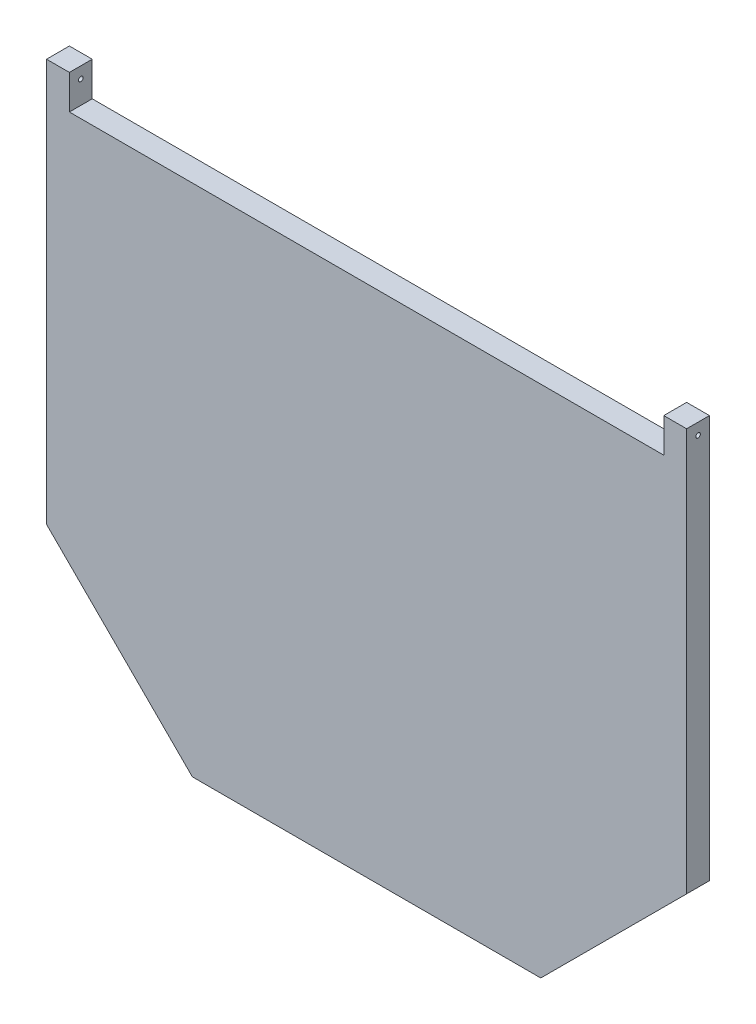
ISO-10303-21;
HEADER;
FILE_DESCRIPTION(('STEP AP214'),'2;1');
FILE_NAME('part.step','',(''),(''),'','','');
FILE_SCHEMA(('AUTOMOTIVE_DESIGN { 1 0 10303 214 1 1 1 1 }'));
ENDSEC;
DATA;
#1=APPLICATION_CONTEXT('core data for automotive mechanical design processes');
#2=APPLICATION_PROTOCOL_DEFINITION('international standard','automotive_design',2000,#1);
#3=PRODUCT_CONTEXT('',#1,'mechanical');
#4=PRODUCT('Part','Part','',(#3));
#5=PRODUCT_RELATED_PRODUCT_CATEGORY('part','',(#4));
#6=PRODUCT_DEFINITION_FORMATION('','',#4);
#7=PRODUCT_DEFINITION_CONTEXT('part definition',#1,'design');
#8=PRODUCT_DEFINITION('design','',#6,#7);
#9=PRODUCT_DEFINITION_SHAPE('','',#8);
#10=(LENGTH_UNIT() NAMED_UNIT(*) SI_UNIT(.MILLI.,.METRE.));
#11=(NAMED_UNIT(*) PLANE_ANGLE_UNIT() SI_UNIT($,.RADIAN.));
#12=(NAMED_UNIT(*) SI_UNIT($,.STERADIAN.) SOLID_ANGLE_UNIT());
#13=UNCERTAINTY_MEASURE_WITH_UNIT(LENGTH_MEASURE(1.E-05),#10,'distance_accuracy_value','');
#14=(GEOMETRIC_REPRESENTATION_CONTEXT(3) GLOBAL_UNCERTAINTY_ASSIGNED_CONTEXT((#13)) GLOBAL_UNIT_ASSIGNED_CONTEXT((#10,
#11,#12)) REPRESENTATION_CONTEXT('',''));
#15=CARTESIAN_POINT('',(0.,0.,0.));
#16=DIRECTION('',(0.,0.,1.));
#17=DIRECTION('',(1.,0.,0.));
#18=AXIS2_PLACEMENT_3D('',#15,#16,#17);
#19=CARTESIAN_POINT('',(0.,0.,0.));
#20=DIRECTION('',(0.,0.,1.));
#21=DIRECTION('',(1.,0.,0.));
#22=AXIS2_PLACEMENT_3D('',#19,#20,#21);
#23=PLANE('',#22);
#24=DIRECTION('',(0.707317073170731,-0.706896426643388,0.));
#25=VECTOR('',#24,1.);
#26=CARTESIAN_POINT('',(10.3378,-219.4901416915,0.));
#27=LINE('',#26,#25);
#28=CARTESIAN_POINT('',(10.3378,-219.4901416915,0.));
#29=VERTEX_POINT('',#28);
#30=CARTESIAN_POINT('',(85.3062558436216,-294.414013257707,0.));
#31=VERTEX_POINT('',#30);
#32=EDGE_CURVE('E222',#29,#31,#27,.T.);
#33=ORIENTED_EDGE('',*,*,#32,.T.);
#34=DIRECTION('',(-0.382546027837966,-0.923936435359811,0.));
#35=VECTOR('',#34,1.);
#36=CARTESIAN_POINT('',(86.2099060705805,-292.2314906101,0.));
#37=LINE('',#36,#35);
#38=CARTESIAN_POINT('',(86.2099060705805,-292.2314906101,0.));
#39=VERTEX_POINT('',#38);
#40=EDGE_CURVE('E51',#39,#31,#37,.T.);
#41=ORIENTED_EDGE('',*,*,#40,.F.);
#42=DIRECTION('',(0.707317073170731,-0.706896426643388,0.));
#43=VECTOR('',#42,1.);
#44=CARTESIAN_POINT('',(12.5203226476069,-218.585730909957,0.));
#45=LINE('',#44,#43);
#46=CARTESIAN_POINT('',(12.5203226476069,-218.585730909957,0.));
#47=VERTEX_POINT('',#46);
#48=EDGE_CURVE('E208',#47,#39,#45,.T.);
#49=ORIENTED_EDGE('',*,*,#48,.F.);
#50=DIRECTION('',(0.,-1.,0.));
#51=VECTOR('',#50,1.);
#52=CARTESIAN_POINT('',(12.5203226476069,-45.9739999999999,0.));
#53=LINE('',#52,#51);
#54=CARTESIAN_POINT('',(12.5203226476069,-45.9739999999999,0.));
#55=VERTEX_POINT('',#54);
#56=EDGE_CURVE('E211',#55,#47,#53,.T.);
#57=ORIENTED_EDGE('',*,*,#56,.F.);
#58=DIRECTION('',(1.,0.,0.));
#59=VECTOR('',#58,1.);
#60=CARTESIAN_POINT('',(10.3378,-45.9739999999999,0.));
#61=LINE('',#60,#59);
#62=CARTESIAN_POINT('',(10.3378,-45.9739999999999,0.));
#63=VERTEX_POINT('',#62);
#64=EDGE_CURVE('E227',#63,#55,#61,.T.);
#65=ORIENTED_EDGE('',*,*,#64,.F.);
#66=DIRECTION('',(0.,-1.,0.));
#67=VECTOR('',#66,1.);
#68=CARTESIAN_POINT('',(10.3378,-45.9739999999999,0.));
#69=LINE('',#68,#67);
#70=EDGE_CURVE('E224',#63,#29,#69,.T.);
#71=ORIENTED_EDGE('',*,*,#70,.T.);
#72=EDGE_LOOP('',(#33,#41,#49,#57,#65,#71));
#73=FACE_BOUND('',#72,.T.);
#74=DIRECTION('',(-1.,0.,0.));
#75=VECTOR('',#74,1.);
#76=CARTESIAN_POINT('',(0.,0.,0.));
#77=LINE('',#76,#75);
#78=CARTESIAN_POINT('',(12.7,0.,0.));
#79=VERTEX_POINT('',#78);
#80=CARTESIAN_POINT('',(0.,0.,0.));
#81=VERTEX_POINT('',#80);
#82=EDGE_CURVE('E345',#79,#81,#77,.T.);
#83=ORIENTED_EDGE('',*,*,#82,.F.);
#84=DIRECTION('',(0.,-1.,0.));
#85=VECTOR('',#84,1.);
#86=CARTESIAN_POINT('',(12.7,0.,0.));
#87=LINE('',#86,#85);
#88=CARTESIAN_POINT('',(12.7,-19.05,0.));
#89=VERTEX_POINT('',#88);
#90=EDGE_CURVE('E292',#79,#89,#87,.T.);
#91=ORIENTED_EDGE('',*,*,#90,.T.);
#92=DIRECTION('',(1.,0.,0.));
#93=VECTOR('',#92,1.);
#94=CARTESIAN_POINT('',(12.7,-19.05,0.));
#95=LINE('',#94,#93);
#96=CARTESIAN_POINT('',(342.9,-19.05,0.));
#97=VERTEX_POINT('',#96);
#98=EDGE_CURVE('E295',#89,#97,#95,.T.);
#99=ORIENTED_EDGE('',*,*,#98,.T.);
#100=DIRECTION('',(0.,1.,0.));
#101=VECTOR('',#100,1.);
#102=CARTESIAN_POINT('',(342.9,0.,0.));
#103=LINE('',#102,#101);
#104=CARTESIAN_POINT('',(342.9,0.,0.));
#105=VERTEX_POINT('',#104);
#106=EDGE_CURVE('E299',#97,#105,#103,.T.);
#107=ORIENTED_EDGE('',*,*,#106,.T.);
#108=CARTESIAN_POINT('',(355.6,0.,0.));
#109=VERTEX_POINT('',#108);
#110=EDGE_CURVE('E322',#109,#105,#77,.T.);
#111=ORIENTED_EDGE('',*,*,#110,.F.);
#112=DIRECTION('',(0.,1.,0.));
#113=VECTOR('',#112,1.);
#114=CARTESIAN_POINT('',(355.6,-223.774,0.));
#115=LINE('',#114,#113);
#116=CARTESIAN_POINT('',(355.6,-223.774,0.));
#117=VERTEX_POINT('',#116);
#118=EDGE_CURVE('E343',#117,#109,#115,.T.);
#119=ORIENTED_EDGE('',*,*,#118,.F.);
#120=DIRECTION('',(0.707317073170732,0.706896426643387,0.));
#121=VECTOR('',#120,1.);
#122=CARTESIAN_POINT('',(274.574,-304.751813257707,0.));
#123=LINE('',#122,#121);
#124=CARTESIAN_POINT('',(274.574,-304.751813257707,0.));
#125=VERTEX_POINT('',#124);
#126=EDGE_CURVE('E341',#125,#117,#123,.T.);
#127=ORIENTED_EDGE('',*,*,#126,.F.);
#128=DIRECTION('',(1.,0.,0.));
#129=VECTOR('',#128,1.);
#130=CARTESIAN_POINT('',(81.026,-304.751813257707,0.));
#131=LINE('',#130,#129);
#132=CARTESIAN_POINT('',(81.026,-304.751813257707,0.));
#133=VERTEX_POINT('',#132);
#134=EDGE_CURVE('E339',#133,#125,#131,.T.);
#135=ORIENTED_EDGE('',*,*,#134,.F.);
#136=DIRECTION('',(0.707317073170731,-0.706896426643388,0.));
#137=VECTOR('',#136,1.);
#138=CARTESIAN_POINT('',(0.,-223.774,0.));
#139=LINE('',#138,#137);
#140=CARTESIAN_POINT('',(0.,-223.774,0.));
#141=VERTEX_POINT('',#140);
#142=EDGE_CURVE('E337',#141,#133,#139,.T.);
#143=ORIENTED_EDGE('',*,*,#142,.F.);
#144=DIRECTION('',(0.,-1.,0.));
#145=VECTOR('',#144,1.);
#146=CARTESIAN_POINT('',(0.,0.,0.));
#147=LINE('',#146,#145);
#148=EDGE_CURVE('E311',#81,#141,#147,.T.);
#149=ORIENTED_EDGE('',*,*,#148,.F.);
#150=EDGE_LOOP('',(#83,#91,#99,#107,#111,#119,#127,#135,#143,#149));
#151=FACE_BOUND('',#150,.T.);
#152=DIRECTION('',(0.382546027837971,-0.923936435359809,0.));
#153=VECTOR('',#152,1.);
#154=CARTESIAN_POINT('',(269.416328936009,-292.294854170837,0.));
#155=LINE('',#154,#153);
#156=CARTESIAN_POINT('',(269.416328936009,-292.294854170837,0.));
#157=VERTEX_POINT('',#156);
#158=CARTESIAN_POINT('',(270.293744156378,-294.414013257707,0.));
#159=VERTEX_POINT('',#158);
#160=EDGE_CURVE('E59',#157,#159,#155,.T.);
#161=ORIENTED_EDGE('',*,*,#160,.T.);
#162=DIRECTION('',(0.707317073170731,0.706896426643388,0.));
#163=VECTOR('',#162,1.);
#164=CARTESIAN_POINT('',(270.293744156378,-294.414013257707,0.));
#165=LINE('',#164,#163);
#166=CARTESIAN_POINT('',(345.2622,-219.4901416915,0.));
#167=VERTEX_POINT('',#166);
#168=EDGE_CURVE('E268',#159,#167,#165,.T.);
#169=ORIENTED_EDGE('',*,*,#168,.T.);
#170=DIRECTION('',(0.,1.,0.));
#171=VECTOR('',#170,1.);
#172=CARTESIAN_POINT('',(345.2622,-219.4901416915,0.));
#173=LINE('',#172,#171);
#174=CARTESIAN_POINT('',(345.2622,-45.974,0.));
#175=VERTEX_POINT('',#174);
#176=EDGE_CURVE('E265',#167,#175,#173,.T.);
#177=ORIENTED_EDGE('',*,*,#176,.T.);
#178=DIRECTION('',(-1.,0.,0.));
#179=VECTOR('',#178,1.);
#180=CARTESIAN_POINT('',(345.2622,-45.974,0.));
#181=LINE('',#180,#179);
#182=CARTESIAN_POINT('',(342.9,-45.974,0.));
#183=VERTEX_POINT('',#182);
#184=EDGE_CURVE('E262',#175,#183,#181,.T.);
#185=ORIENTED_EDGE('',*,*,#184,.T.);
#186=DIRECTION('',(0.,-1.,0.));
#187=VECTOR('',#186,1.);
#188=CARTESIAN_POINT('',(342.9,-45.974,0.));
#189=LINE('',#188,#187);
#190=CARTESIAN_POINT('',(342.9,-218.511274805283,0.));
#191=VERTEX_POINT('',#190);
#192=EDGE_CURVE('E258',#183,#191,#189,.T.);
#193=ORIENTED_EDGE('',*,*,#192,.T.);
#194=DIRECTION('',(-0.705665301909246,-0.708545327894647,0.));
#195=VECTOR('',#194,1.);
#196=CARTESIAN_POINT('',(342.9,-218.511274805283,0.));
#197=LINE('',#196,#195);
#198=EDGE_CURVE('E255',#191,#157,#197,.T.);
#199=ORIENTED_EDGE('',*,*,#198,.T.);
#200=EDGE_LOOP('',(#161,#169,#177,#185,#193,#199));
#201=FACE_BOUND('',#200,.T.);
#202=ADVANCED_FACE('F35',(#73,#151,#201),#23,.F.);
#203=CARTESIAN_POINT('',(0.,0.,12.7));
#204=DIRECTION('',(0.,-1.,0.));
#205=DIRECTION('',(0.,0.,-1.));
#206=AXIS2_PLACEMENT_3D('',#203,#204,#205);
#207=PLANE('',#206);
#208=DIRECTION('',(-1.,0.,0.));
#209=VECTOR('',#208,1.);
#210=CARTESIAN_POINT('',(0.,0.,12.7));
#211=LINE('',#210,#209);
#212=CARTESIAN_POINT('',(12.7,0.,12.7));
#213=VERTEX_POINT('',#212);
#214=CARTESIAN_POINT('',(0.,0.,12.7));
#215=VERTEX_POINT('',#214);
#216=EDGE_CURVE('E330',#213,#215,#211,.T.);
#217=ORIENTED_EDGE('',*,*,#216,.F.);
#218=DIRECTION('',(0.,0.,1.));
#219=VECTOR('',#218,1.);
#220=CARTESIAN_POINT('',(12.7,0.,0.));
#221=LINE('',#220,#219);
#222=EDGE_CURVE('E309',#79,#213,#221,.T.);
#223=ORIENTED_EDGE('',*,*,#222,.F.);
#224=ORIENTED_EDGE('',*,*,#82,.T.);
#225=DIRECTION('',(0.,0.,-1.));
#226=VECTOR('',#225,1.);
#227=CARTESIAN_POINT('',(0.,0.,12.7));
#228=LINE('',#227,#226);
#229=EDGE_CURVE('E334',#215,#81,#228,.T.);
#230=ORIENTED_EDGE('',*,*,#229,.F.);
#231=EDGE_LOOP('',(#217,#223,#224,#230));
#232=FACE_BOUND('',#231,.T.);
#233=ADVANCED_FACE('F395',(#232),#207,.F.);
#234=CARTESIAN_POINT('',(0.,0.,12.7));
#235=DIRECTION('',(1.,0.,0.));
#236=DIRECTION('',(0.,1.,0.));
#237=AXIS2_PLACEMENT_3D('',#234,#235,#236);
#238=PLANE('',#237);
#239=CARTESIAN_POINT('',(-1.31531814069524E-13,-6.35,6.35));
#240=DIRECTION('',(-1.,0.,0.));
#241=DIRECTION('',(0.,-1.,0.));
#242=AXIS2_PLACEMENT_3D('',#239,#240,#241);
#243=CIRCLE('',#242,1.27);
#244=CARTESIAN_POINT('',(-1.57838176883428E-13,-7.62,6.35));
#245=VERTEX_POINT('',#244);
#246=EDGE_CURVE('E234',#245,#245,#243,.T.);
#247=ORIENTED_EDGE('',*,*,#246,.F.);
#248=EDGE_LOOP('',(#247));
#249=FACE_BOUND('',#248,.T.);
#250=ORIENTED_EDGE('',*,*,#148,.T.);
#251=DIRECTION('',(0.,0.,-1.));
#252=VECTOR('',#251,1.);
#253=CARTESIAN_POINT('',(0.,-223.774,12.7));
#254=LINE('',#253,#252);
#255=CARTESIAN_POINT('',(0.,-223.774,12.7));
#256=VERTEX_POINT('',#255);
#257=EDGE_CURVE('E11',#256,#141,#254,.T.);
#258=ORIENTED_EDGE('',*,*,#257,.F.);
#259=DIRECTION('',(0.,-1.,0.));
#260=VECTOR('',#259,1.);
#261=CARTESIAN_POINT('',(0.,0.,12.7));
#262=LINE('',#261,#260);
#263=EDGE_CURVE('E318',#215,#256,#262,.T.);
#264=ORIENTED_EDGE('',*,*,#263,.F.);
#265=ORIENTED_EDGE('',*,*,#229,.T.);
#266=EDGE_LOOP('',(#250,#258,#264,#265));
#267=FACE_BOUND('',#266,.T.);
#268=ADVANCED_FACE('F37',(#249,#267),#238,.F.);
#269=CARTESIAN_POINT('',(0.,-223.774,12.7));
#270=DIRECTION('',(0.706896426643387,0.707317073170731,0.));
#271=DIRECTION('',(-0.707317073170731,0.706896426643388,0.));
#272=AXIS2_PLACEMENT_3D('',#269,#270,#271);
#273=PLANE('',#272);
#274=ORIENTED_EDGE('',*,*,#142,.T.);
#275=DIRECTION('',(0.,0.,-1.));
#276=VECTOR('',#275,1.);
#277=CARTESIAN_POINT('',(81.026,-304.751813257707,12.7));
#278=LINE('',#277,#276);
#279=CARTESIAN_POINT('',(81.026,-304.751813257707,12.7));
#280=VERTEX_POINT('',#279);
#281=EDGE_CURVE('E44',#280,#133,#278,.T.);
#282=ORIENTED_EDGE('',*,*,#281,.F.);
#283=DIRECTION('',(0.707317073170731,-0.706896426643388,0.));
#284=VECTOR('',#283,1.);
#285=CARTESIAN_POINT('',(0.,-223.774,12.7));
#286=LINE('',#285,#284);
#287=EDGE_CURVE('E321',#256,#280,#286,.T.);
#288=ORIENTED_EDGE('',*,*,#287,.F.);
#289=ORIENTED_EDGE('',*,*,#257,.T.);
#290=EDGE_LOOP('',(#274,#282,#288,#289));
#291=FACE_BOUND('',#290,.T.);
#292=ADVANCED_FACE('F389',(#291),#273,.F.);
#293=CARTESIAN_POINT('',(81.026,-304.751813257707,12.7));
#294=DIRECTION('',(0.,1.,0.));
#295=DIRECTION('',(0.,0.,1.));
#296=AXIS2_PLACEMENT_3D('',#293,#294,#295);
#297=PLANE('',#296);
#298=ORIENTED_EDGE('',*,*,#134,.T.);
#299=DIRECTION('',(0.,0.,-1.));
#300=VECTOR('',#299,1.);
#301=CARTESIAN_POINT('',(274.574,-304.751813257707,12.7));
#302=LINE('',#301,#300);
#303=CARTESIAN_POINT('',(274.574,-304.751813257707,12.7));
#304=VERTEX_POINT('',#303);
#305=EDGE_CURVE('E356',#304,#125,#302,.T.);
#306=ORIENTED_EDGE('',*,*,#305,.F.);
#307=DIRECTION('',(1.,0.,0.));
#308=VECTOR('',#307,1.);
#309=CARTESIAN_POINT('',(81.026,-304.751813257707,12.7));
#310=LINE('',#309,#308);
#311=EDGE_CURVE('E324',#280,#304,#310,.T.);
#312=ORIENTED_EDGE('',*,*,#311,.F.);
#313=ORIENTED_EDGE('',*,*,#281,.T.);
#314=EDGE_LOOP('',(#298,#306,#312,#313));
#315=FACE_BOUND('',#314,.T.);
#316=ADVANCED_FACE('F364',(#315),#297,.F.);
#317=CARTESIAN_POINT('',(274.574,-304.751813257707,12.7));
#318=DIRECTION('',(-0.706896426643387,0.707317073170731,0.));
#319=DIRECTION('',(-0.707317073170731,-0.706896426643387,0.));
#320=AXIS2_PLACEMENT_3D('',#317,#318,#319);
#321=PLANE('',#320);
#322=ORIENTED_EDGE('',*,*,#126,.T.);
#323=DIRECTION('',(0.,0.,-1.));
#324=VECTOR('',#323,1.);
#325=CARTESIAN_POINT('',(355.6,-223.774,12.7));
#326=LINE('',#325,#324);
#327=CARTESIAN_POINT('',(355.6,-223.774,12.7));
#328=VERTEX_POINT('',#327);
#329=EDGE_CURVE('E353',#328,#117,#326,.T.);
#330=ORIENTED_EDGE('',*,*,#329,.F.);
#331=DIRECTION('',(0.707317073170732,0.706896426643387,0.));
#332=VECTOR('',#331,1.);
#333=CARTESIAN_POINT('',(274.574,-304.751813257707,12.7));
#334=LINE('',#333,#332);
#335=EDGE_CURVE('E326',#304,#328,#334,.T.);
#336=ORIENTED_EDGE('',*,*,#335,.F.);
#337=ORIENTED_EDGE('',*,*,#305,.T.);
#338=EDGE_LOOP('',(#322,#330,#336,#337));
#339=FACE_BOUND('',#338,.T.);
#340=ADVANCED_FACE('F376',(#339),#321,.F.);
#341=CARTESIAN_POINT('',(355.6,-223.774,12.7));
#342=DIRECTION('',(-1.,0.,0.));
#343=DIRECTION('',(0.,0.,1.));
#344=AXIS2_PLACEMENT_3D('',#341,#342,#343);
#345=PLANE('',#344);
#346=CARTESIAN_POINT('',(355.600000000006,-6.35000000000737,6.35));
#347=DIRECTION('',(-1.,0.,0.));
#348=DIRECTION('',(0.,-1.,0.));
#349=AXIS2_PLACEMENT_3D('',#346,#347,#348);
#350=CIRCLE('',#349,1.27);
#351=CARTESIAN_POINT('',(355.600000000006,-7.62000000000737,6.35));
#352=VERTEX_POINT('',#351);
#353=EDGE_CURVE('E283',#352,#352,#350,.T.);
#354=ORIENTED_EDGE('',*,*,#353,.T.);
#355=EDGE_LOOP('',(#354));
#356=FACE_BOUND('',#355,.T.);
#357=ORIENTED_EDGE('',*,*,#118,.T.);
#358=DIRECTION('',(0.,0.,-1.));
#359=VECTOR('',#358,1.);
#360=CARTESIAN_POINT('',(355.6,0.,12.7));
#361=LINE('',#360,#359);
#362=CARTESIAN_POINT('',(355.6,0.,12.7));
#363=VERTEX_POINT('',#362);
#364=EDGE_CURVE('E350',#363,#109,#361,.T.);
#365=ORIENTED_EDGE('',*,*,#364,.F.);
#366=DIRECTION('',(0.,1.,0.));
#367=VECTOR('',#366,1.);
#368=CARTESIAN_POINT('',(355.6,-223.774,12.7));
#369=LINE('',#368,#367);
#370=EDGE_CURVE('E328',#328,#363,#369,.T.);
#371=ORIENTED_EDGE('',*,*,#370,.F.);
#372=ORIENTED_EDGE('',*,*,#329,.T.);
#373=EDGE_LOOP('',(#357,#365,#371,#372));
#374=FACE_BOUND('',#373,.T.);
#375=ADVANCED_FACE('F380',(#356,#374),#345,.F.);
#376=ORIENTED_EDGE('',*,*,#110,.T.);
#377=DIRECTION('',(0.,0.,1.));
#378=VECTOR('',#377,1.);
#379=CARTESIAN_POINT('',(342.9,0.,0.));
#380=LINE('',#379,#378);
#381=CARTESIAN_POINT('',(342.9,0.,12.7));
#382=VERTEX_POINT('',#381);
#383=EDGE_CURVE('E312',#105,#382,#380,.T.);
#384=ORIENTED_EDGE('',*,*,#383,.T.);
#385=EDGE_CURVE('E331',#363,#382,#211,.T.);
#386=ORIENTED_EDGE('',*,*,#385,.F.);
#387=ORIENTED_EDGE('',*,*,#364,.T.);
#388=EDGE_LOOP('',(#376,#384,#386,#387));
#389=FACE_BOUND('',#388,.T.);
#390=ADVANCED_FACE('F405',(#389),#207,.F.);
#391=CARTESIAN_POINT('',(0.,0.,12.7));
#392=DIRECTION('',(0.,0.,1.));
#393=DIRECTION('',(1.,0.,0.));
#394=AXIS2_PLACEMENT_3D('',#391,#392,#393);
#395=PLANE('',#394);
#396=DIRECTION('',(0.,-1.,0.));
#397=VECTOR('',#396,1.);
#398=CARTESIAN_POINT('',(12.7,0.,12.7));
#399=LINE('',#398,#397);
#400=CARTESIAN_POINT('',(12.7,-19.05,12.7));
#401=VERTEX_POINT('',#400);
#402=EDGE_CURVE('E291',#213,#401,#399,.T.);
#403=ORIENTED_EDGE('',*,*,#402,.F.);
#404=ORIENTED_EDGE('',*,*,#216,.T.);
#405=ORIENTED_EDGE('',*,*,#263,.T.);
#406=ORIENTED_EDGE('',*,*,#287,.T.);
#407=ORIENTED_EDGE('',*,*,#311,.T.);
#408=ORIENTED_EDGE('',*,*,#335,.T.);
#409=ORIENTED_EDGE('',*,*,#370,.T.);
#410=ORIENTED_EDGE('',*,*,#385,.T.);
#411=DIRECTION('',(0.,1.,0.));
#412=VECTOR('',#411,1.);
#413=CARTESIAN_POINT('',(342.9,0.,12.7));
#414=LINE('',#413,#412);
#415=CARTESIAN_POINT('',(342.9,-19.05,12.7));
#416=VERTEX_POINT('',#415);
#417=EDGE_CURVE('E296',#416,#382,#414,.T.);
#418=ORIENTED_EDGE('',*,*,#417,.F.);
#419=DIRECTION('',(1.,0.,0.));
#420=VECTOR('',#419,1.);
#421=CARTESIAN_POINT('',(12.7,-19.05,12.7));
#422=LINE('',#421,#420);
#423=EDGE_CURVE('E305',#401,#416,#422,.T.);
#424=ORIENTED_EDGE('',*,*,#423,.F.);
#425=EDGE_LOOP('',(#403,#404,#405,#406,#407,#408,#409,#410,#418,#424));
#426=FACE_BOUND('',#425,.T.);
#427=ADVANCED_FACE('F385',(#426),#395,.T.);
#428=CARTESIAN_POINT('',(12.7,0.,0.));
#429=DIRECTION('',(-1.,0.,0.));
#430=DIRECTION('',(0.,-1.,0.));
#431=AXIS2_PLACEMENT_3D('',#428,#429,#430);
#432=PLANE('',#431);
#433=CARTESIAN_POINT('',(12.7,-6.35000000000026,6.35));
#434=DIRECTION('',(-1.,0.,0.));
#435=DIRECTION('',(0.,-1.,0.));
#436=AXIS2_PLACEMENT_3D('',#433,#434,#435);
#437=CIRCLE('',#436,1.27);
#438=CARTESIAN_POINT('',(12.7,-7.62000000000026,6.35));
#439=VERTEX_POINT('',#438);
#440=EDGE_CURVE('E288',#439,#439,#437,.T.);
#441=ORIENTED_EDGE('',*,*,#440,.T.);
#442=EDGE_LOOP('',(#441));
#443=FACE_BOUND('',#442,.T.);
#444=ORIENTED_EDGE('',*,*,#402,.T.);
#445=DIRECTION('',(0.,0.,1.));
#446=VECTOR('',#445,1.);
#447=CARTESIAN_POINT('',(12.7,-19.05,0.));
#448=LINE('',#447,#446);
#449=EDGE_CURVE('E302',#89,#401,#448,.T.);
#450=ORIENTED_EDGE('',*,*,#449,.F.);
#451=ORIENTED_EDGE('',*,*,#90,.F.);
#452=ORIENTED_EDGE('',*,*,#222,.T.);
#453=EDGE_LOOP('',(#444,#450,#451,#452));
#454=FACE_BOUND('',#453,.T.);
#455=ADVANCED_FACE('F397',(#443,#454),#432,.F.);
#456=CARTESIAN_POINT('',(342.9,0.,0.));
#457=DIRECTION('',(1.,0.,0.));
#458=DIRECTION('',(0.,0.,-1.));
#459=AXIS2_PLACEMENT_3D('',#456,#457,#458);
#460=PLANE('',#459);
#461=CARTESIAN_POINT('',(342.9,-6.3500000000071,6.35));
#462=DIRECTION('',(1.,0.,0.));
#463=DIRECTION('',(0.,0.,-1.));
#464=AXIS2_PLACEMENT_3D('',#461,#462,#463);
#465=CIRCLE('',#464,1.27);
#466=CARTESIAN_POINT('',(342.9,-6.3500000000071,5.08));
#467=VERTEX_POINT('',#466);
#468=EDGE_CURVE('E39',#467,#467,#465,.T.);
#469=ORIENTED_EDGE('',*,*,#468,.T.);
#470=EDGE_LOOP('',(#469));
#471=FACE_BOUND('',#470,.T.);
#472=ORIENTED_EDGE('',*,*,#417,.T.);
#473=ORIENTED_EDGE('',*,*,#383,.F.);
#474=ORIENTED_EDGE('',*,*,#106,.F.);
#475=DIRECTION('',(0.,0.,1.));
#476=VECTOR('',#475,1.);
#477=CARTESIAN_POINT('',(342.9,-19.05,0.));
#478=LINE('',#477,#476);
#479=EDGE_CURVE('E315',#97,#416,#478,.T.);
#480=ORIENTED_EDGE('',*,*,#479,.T.);
#481=EDGE_LOOP('',(#472,#473,#474,#480));
#482=FACE_BOUND('',#481,.T.);
#483=ADVANCED_FACE('F406',(#471,#482),#460,.F.);
#484=CARTESIAN_POINT('',(12.7,-19.05,0.));
#485=DIRECTION('',(0.,-1.,0.));
#486=DIRECTION('',(0.,0.,-1.));
#487=AXIS2_PLACEMENT_3D('',#484,#485,#486);
#488=PLANE('',#487);
#489=ORIENTED_EDGE('',*,*,#423,.T.);
#490=ORIENTED_EDGE('',*,*,#479,.F.);
#491=ORIENTED_EDGE('',*,*,#98,.F.);
#492=ORIENTED_EDGE('',*,*,#449,.T.);
#493=EDGE_LOOP('',(#489,#490,#491,#492));
#494=FACE_BOUND('',#493,.T.);
#495=ADVANCED_FACE('F401',(#494),#488,.F.);
#496=CARTESIAN_POINT('',(355.600000000006,-6.35000000000737,6.35));
#497=DIRECTION('',(-1.,0.,0.));
#498=DIRECTION('',(0.,-1.,0.));
#499=AXIS2_PLACEMENT_3D('',#496,#497,#498);
#500=CYLINDRICAL_SURFACE('',#499,1.27);
#501=ORIENTED_EDGE('',*,*,#353,.F.);
#502=EDGE_LOOP('',(#501));
#503=FACE_BOUND('',#502,.T.);
#504=ORIENTED_EDGE('',*,*,#468,.F.);
#505=EDGE_LOOP('',(#504));
#506=FACE_BOUND('',#505,.T.);
#507=ADVANCED_FACE('F414',(#503,#506),#500,.F.);
#508=ORIENTED_EDGE('',*,*,#246,.T.);
#509=EDGE_LOOP('',(#508));
#510=FACE_BOUND('',#509,.T.);
#511=ORIENTED_EDGE('',*,*,#440,.F.);
#512=EDGE_LOOP('',(#511));
#513=FACE_BOUND('',#512,.T.);
#514=ADVANCED_FACE('F445',(#510,#513),#500,.F.);
#515=CARTESIAN_POINT('',(269.416328936009,-292.294854170837,6.35));
#516=DIRECTION('',(0.923936435359809,0.382546027837971,0.));
#517=DIRECTION('',(-0.382546027837971,0.923936435359809,0.));
#518=AXIS2_PLACEMENT_3D('',#515,#516,#517);
#519=PLANE('',#518);
#520=ORIENTED_EDGE('',*,*,#160,.F.);
#521=DIRECTION('',(0.,0.,-1.));
#522=VECTOR('',#521,1.);
#523=CARTESIAN_POINT('',(269.416328936009,-292.294854170837,6.35));
#524=LINE('',#523,#522);
#525=CARTESIAN_POINT('',(269.416328936009,-292.294854170837,6.35));
#526=VERTEX_POINT('',#525);
#527=EDGE_CURVE('E252',#526,#157,#524,.T.);
#528=ORIENTED_EDGE('',*,*,#527,.F.);
#529=DIRECTION('',(0.382546027837971,-0.923936435359809,0.));
#530=VECTOR('',#529,1.);
#531=CARTESIAN_POINT('',(269.416328936009,-292.294854170837,6.35));
#532=LINE('',#531,#530);
#533=CARTESIAN_POINT('',(270.293744156378,-294.414013257707,6.35));
#534=VERTEX_POINT('',#533);
#535=EDGE_CURVE('E259',#526,#534,#532,.T.);
#536=ORIENTED_EDGE('',*,*,#535,.T.);
#537=DIRECTION('',(0.,0.,-1.));
#538=VECTOR('',#537,1.);
#539=CARTESIAN_POINT('',(270.293744156378,-294.414013257707,6.35));
#540=LINE('',#539,#538);
#541=EDGE_CURVE('E242',#534,#159,#540,.T.);
#542=ORIENTED_EDGE('',*,*,#541,.T.);
#543=EDGE_LOOP('',(#520,#528,#536,#542));
#544=FACE_BOUND('',#543,.T.);
#545=ADVANCED_FACE('F448',(#544),#519,.T.);
#546=CARTESIAN_POINT('',(270.293744156378,-294.414013257707,6.35));
#547=DIRECTION('',(-0.706896426643387,0.707317073170731,0.));
#548=DIRECTION('',(-0.707317073170731,-0.706896426643388,0.));
#549=AXIS2_PLACEMENT_3D('',#546,#547,#548);
#550=PLANE('',#549);
#551=ORIENTED_EDGE('',*,*,#168,.F.);
#552=ORIENTED_EDGE('',*,*,#541,.F.);
#553=DIRECTION('',(0.707317073170731,0.706896426643388,0.));
#554=VECTOR('',#553,1.);
#555=CARTESIAN_POINT('',(270.293744156378,-294.414013257707,6.35));
#556=LINE('',#555,#554);
#557=CARTESIAN_POINT('',(345.2622,-219.4901416915,6.35));
#558=VERTEX_POINT('',#557);
#559=EDGE_CURVE('E279',#534,#558,#556,.T.);
#560=ORIENTED_EDGE('',*,*,#559,.T.);
#561=DIRECTION('',(0.,0.,-1.));
#562=VECTOR('',#561,1.);
#563=CARTESIAN_POINT('',(345.2622,-219.4901416915,6.35));
#564=LINE('',#563,#562);
#565=EDGE_CURVE('E244',#558,#167,#564,.T.);
#566=ORIENTED_EDGE('',*,*,#565,.T.);
#567=EDGE_LOOP('',(#551,#552,#560,#566));
#568=FACE_BOUND('',#567,.T.);
#569=ADVANCED_FACE('F454',(#568),#550,.T.);
#570=CARTESIAN_POINT('',(345.2622,-219.4901416915,6.35));
#571=DIRECTION('',(-1.,0.,0.));
#572=DIRECTION('',(0.,0.,1.));
#573=AXIS2_PLACEMENT_3D('',#570,#571,#572);
#574=PLANE('',#573);
#575=ORIENTED_EDGE('',*,*,#176,.F.);
#576=ORIENTED_EDGE('',*,*,#565,.F.);
#577=DIRECTION('',(0.,1.,0.));
#578=VECTOR('',#577,1.);
#579=CARTESIAN_POINT('',(345.2622,-219.4901416915,6.35));
#580=LINE('',#579,#578);
#581=CARTESIAN_POINT('',(345.2622,-45.974,6.35));
#582=VERTEX_POINT('',#581);
#583=EDGE_CURVE('E277',#558,#582,#580,.T.);
#584=ORIENTED_EDGE('',*,*,#583,.T.);
#585=DIRECTION('',(0.,0.,-1.));
#586=VECTOR('',#585,1.);
#587=CARTESIAN_POINT('',(345.2622,-45.974,6.35));
#588=LINE('',#587,#586);
#589=EDGE_CURVE('E246',#582,#175,#588,.T.);
#590=ORIENTED_EDGE('',*,*,#589,.T.);
#591=EDGE_LOOP('',(#575,#576,#584,#590));
#592=FACE_BOUND('',#591,.T.);
#593=ADVANCED_FACE('F473',(#592),#574,.T.);
#594=CARTESIAN_POINT('',(345.2622,-45.974,6.35));
#595=DIRECTION('',(0.,-1.,0.));
#596=DIRECTION('',(0.,0.,-1.));
#597=AXIS2_PLACEMENT_3D('',#594,#595,#596);
#598=PLANE('',#597);
#599=ORIENTED_EDGE('',*,*,#184,.F.);
#600=ORIENTED_EDGE('',*,*,#589,.F.);
#601=DIRECTION('',(-1.,0.,0.));
#602=VECTOR('',#601,1.);
#603=CARTESIAN_POINT('',(345.2622,-45.974,6.35));
#604=LINE('',#603,#602);
#605=CARTESIAN_POINT('',(342.9,-45.974,6.35));
#606=VERTEX_POINT('',#605);
#607=EDGE_CURVE('E275',#582,#606,#604,.T.);
#608=ORIENTED_EDGE('',*,*,#607,.T.);
#609=DIRECTION('',(0.,0.,-1.));
#610=VECTOR('',#609,1.);
#611=CARTESIAN_POINT('',(342.9,-45.974,6.35));
#612=LINE('',#611,#610);
#613=EDGE_CURVE('E248',#606,#183,#612,.T.);
#614=ORIENTED_EDGE('',*,*,#613,.T.);
#615=EDGE_LOOP('',(#599,#600,#608,#614));
#616=FACE_BOUND('',#615,.T.);
#617=ADVANCED_FACE('F469',(#616),#598,.T.);
#618=CARTESIAN_POINT('',(342.9,-45.974,6.35));
#619=DIRECTION('',(1.,0.,0.));
#620=DIRECTION('',(0.,0.,-1.));
#621=AXIS2_PLACEMENT_3D('',#618,#619,#620);
#622=PLANE('',#621);
#623=ORIENTED_EDGE('',*,*,#192,.F.);
#624=ORIENTED_EDGE('',*,*,#613,.F.);
#625=DIRECTION('',(0.,-1.,0.));
#626=VECTOR('',#625,1.);
#627=CARTESIAN_POINT('',(342.9,-45.974,6.35));
#628=LINE('',#627,#626);
#629=CARTESIAN_POINT('',(342.9,-218.511274805283,6.35));
#630=VERTEX_POINT('',#629);
#631=EDGE_CURVE('E273',#606,#630,#628,.T.);
#632=ORIENTED_EDGE('',*,*,#631,.T.);
#633=DIRECTION('',(0.,0.,-1.));
#634=VECTOR('',#633,1.);
#635=CARTESIAN_POINT('',(342.9,-218.511274805283,6.35));
#636=LINE('',#635,#634);
#637=EDGE_CURVE('E250',#630,#191,#636,.T.);
#638=ORIENTED_EDGE('',*,*,#637,.T.);
#639=EDGE_LOOP('',(#623,#624,#632,#638));
#640=FACE_BOUND('',#639,.T.);
#641=ADVANCED_FACE('F465',(#640),#622,.T.);
#642=CARTESIAN_POINT('',(342.9,-218.511274805283,6.35));
#643=DIRECTION('',(0.708545327894647,-0.705665301909246,0.));
#644=DIRECTION('',(0.705665301909246,0.708545327894647,0.));
#645=AXIS2_PLACEMENT_3D('',#642,#643,#644);
#646=PLANE('',#645);
#647=ORIENTED_EDGE('',*,*,#198,.F.);
#648=ORIENTED_EDGE('',*,*,#637,.F.);
#649=DIRECTION('',(-0.705665301909246,-0.708545327894647,0.));
#650=VECTOR('',#649,1.);
#651=CARTESIAN_POINT('',(342.9,-218.511274805283,6.35));
#652=LINE('',#651,#650);
#653=EDGE_CURVE('E254',#630,#526,#652,.T.);
#654=ORIENTED_EDGE('',*,*,#653,.T.);
#655=ORIENTED_EDGE('',*,*,#527,.T.);
#656=EDGE_LOOP('',(#647,#648,#654,#655));
#657=FACE_BOUND('',#656,.T.);
#658=ADVANCED_FACE('F461',(#657),#646,.T.);
#659=CARTESIAN_POINT('',(0.,0.,6.35));
#660=DIRECTION('',(0.,0.,1.));
#661=DIRECTION('',(1.,0.,0.));
#662=AXIS2_PLACEMENT_3D('',#659,#660,#661);
#663=PLANE('',#662);
#664=ORIENTED_EDGE('',*,*,#535,.F.);
#665=ORIENTED_EDGE('',*,*,#653,.F.);
#666=ORIENTED_EDGE('',*,*,#631,.F.);
#667=ORIENTED_EDGE('',*,*,#607,.F.);
#668=ORIENTED_EDGE('',*,*,#583,.F.);
#669=ORIENTED_EDGE('',*,*,#559,.F.);
#670=EDGE_LOOP('',(#664,#665,#666,#667,#668,#669));
#671=FACE_BOUND('',#670,.T.);
#672=ADVANCED_FACE('F458',(#671),#663,.F.);
#673=CARTESIAN_POINT('',(86.2099060705805,-292.2314906101,6.35));
#674=DIRECTION('',(0.923936435359811,-0.382546027837966,0.));
#675=DIRECTION('',(0.382546027837966,0.923936435359811,0.));
#676=AXIS2_PLACEMENT_3D('',#673,#674,#675);
#677=PLANE('',#676);
#678=ORIENTED_EDGE('',*,*,#40,.T.);
#679=DIRECTION('',(0.,0.,-1.));
#680=VECTOR('',#679,1.);
#681=CARTESIAN_POINT('',(85.3062558436216,-294.414013257707,6.35));
#682=LINE('',#681,#680);
#683=CARTESIAN_POINT('',(85.3062558436216,-294.414013257707,6.35));
#684=VERTEX_POINT('',#683);
#685=EDGE_CURVE('E191',#684,#31,#682,.T.);
#686=ORIENTED_EDGE('',*,*,#685,.F.);
#687=DIRECTION('',(-0.382546027837966,-0.923936435359811,0.));
#688=VECTOR('',#687,1.);
#689=CARTESIAN_POINT('',(86.2099060705805,-292.2314906101,6.35));
#690=LINE('',#689,#688);
#691=CARTESIAN_POINT('',(86.2099060705805,-292.2314906101,6.35));
#692=VERTEX_POINT('',#691);
#693=EDGE_CURVE('E198',#692,#684,#690,.T.);
#694=ORIENTED_EDGE('',*,*,#693,.F.);
#695=DIRECTION('',(0.,0.,-1.));
#696=VECTOR('',#695,1.);
#697=CARTESIAN_POINT('',(86.2099060705805,-292.2314906101,6.35));
#698=LINE('',#697,#696);
#699=EDGE_CURVE('E232',#692,#39,#698,.T.);
#700=ORIENTED_EDGE('',*,*,#699,.T.);
#701=EDGE_LOOP('',(#678,#686,#694,#700));
#702=FACE_BOUND('',#701,.T.);
#703=ADVANCED_FACE('F201',(#702),#677,.F.);
#704=CARTESIAN_POINT('',(12.5203226476069,-218.585730909957,6.35));
#705=DIRECTION('',(0.706896426643388,0.707317073170731,0.));
#706=DIRECTION('',(-0.707317073170731,0.706896426643388,0.));
#707=AXIS2_PLACEMENT_3D('',#704,#705,#706);
#708=PLANE('',#707);
#709=ORIENTED_EDGE('',*,*,#48,.T.);
#710=ORIENTED_EDGE('',*,*,#699,.F.);
#711=DIRECTION('',(0.707317073170731,-0.706896426643388,0.));
#712=VECTOR('',#711,1.);
#713=CARTESIAN_POINT('',(12.5203226476069,-218.585730909957,6.35));
#714=LINE('',#713,#712);
#715=CARTESIAN_POINT('',(12.5203226476069,-218.585730909957,6.35));
#716=VERTEX_POINT('',#715);
#717=EDGE_CURVE('E203',#716,#692,#714,.T.);
#718=ORIENTED_EDGE('',*,*,#717,.F.);
#719=DIRECTION('',(0.,0.,-1.));
#720=VECTOR('',#719,1.);
#721=CARTESIAN_POINT('',(12.5203226476069,-218.585730909957,6.35));
#722=LINE('',#721,#720);
#723=EDGE_CURVE('E235',#716,#47,#722,.T.);
#724=ORIENTED_EDGE('',*,*,#723,.T.);
#725=EDGE_LOOP('',(#709,#710,#718,#724));
#726=FACE_BOUND('',#725,.T.);
#727=ADVANCED_FACE('F483',(#726),#708,.F.);
#728=CARTESIAN_POINT('',(12.5203226476069,-45.9739999999999,6.35));
#729=DIRECTION('',(1.,0.,0.));
#730=DIRECTION('',(0.,1.,0.));
#731=AXIS2_PLACEMENT_3D('',#728,#729,#730);
#732=PLANE('',#731);
#733=ORIENTED_EDGE('',*,*,#56,.T.);
#734=ORIENTED_EDGE('',*,*,#723,.F.);
#735=DIRECTION('',(0.,-1.,0.));
#736=VECTOR('',#735,1.);
#737=CARTESIAN_POINT('',(12.5203226476069,-45.9739999999999,6.35));
#738=LINE('',#737,#736);
#739=CARTESIAN_POINT('',(12.5203226476069,-45.9739999999999,6.35));
#740=VERTEX_POINT('',#739);
#741=EDGE_CURVE('E218',#740,#716,#738,.T.);
#742=ORIENTED_EDGE('',*,*,#741,.F.);
#743=DIRECTION('',(0.,0.,-1.));
#744=VECTOR('',#743,1.);
#745=CARTESIAN_POINT('',(12.5203226476069,-45.9739999999999,6.35));
#746=LINE('',#745,#744);
#747=EDGE_CURVE('E237',#740,#55,#746,.T.);
#748=ORIENTED_EDGE('',*,*,#747,.T.);
#749=EDGE_LOOP('',(#733,#734,#742,#748));
#750=FACE_BOUND('',#749,.T.);
#751=ADVANCED_FACE('F493',(#750),#732,.F.);
#752=CARTESIAN_POINT('',(10.3378,-45.9739999999999,6.35));
#753=DIRECTION('',(0.,1.,0.));
#754=DIRECTION('',(0.,0.,1.));
#755=AXIS2_PLACEMENT_3D('',#752,#753,#754);
#756=PLANE('',#755);
#757=ORIENTED_EDGE('',*,*,#64,.T.);
#758=ORIENTED_EDGE('',*,*,#747,.F.);
#759=DIRECTION('',(1.,0.,0.));
#760=VECTOR('',#759,1.);
#761=CARTESIAN_POINT('',(10.3378,-45.9739999999999,6.35));
#762=LINE('',#761,#760);
#763=CARTESIAN_POINT('',(10.3378,-45.9739999999999,6.35));
#764=VERTEX_POINT('',#763);
#765=EDGE_CURVE('E215',#764,#740,#762,.T.);
#766=ORIENTED_EDGE('',*,*,#765,.F.);
#767=DIRECTION('',(0.,0.,-1.));
#768=VECTOR('',#767,1.);
#769=CARTESIAN_POINT('',(10.3378,-45.9739999999999,6.35));
#770=LINE('',#769,#768);
#771=EDGE_CURVE('E239',#764,#63,#770,.T.);
#772=ORIENTED_EDGE('',*,*,#771,.T.);
#773=EDGE_LOOP('',(#757,#758,#766,#772));
#774=FACE_BOUND('',#773,.T.);
#775=ADVANCED_FACE('F489',(#774),#756,.F.);
#776=CARTESIAN_POINT('',(10.3378,-45.9739999999999,6.35));
#777=DIRECTION('',(1.,0.,0.));
#778=DIRECTION('',(0.,1.,0.));
#779=AXIS2_PLACEMENT_3D('',#776,#777,#778);
#780=PLANE('',#779);
#781=ORIENTED_EDGE('',*,*,#70,.F.);
#782=ORIENTED_EDGE('',*,*,#771,.F.);
#783=DIRECTION('',(0.,-1.,0.));
#784=VECTOR('',#783,1.);
#785=CARTESIAN_POINT('',(10.3378,-45.9739999999999,6.35));
#786=LINE('',#785,#784);
#787=CARTESIAN_POINT('',(10.3378,-219.4901416915,6.35));
#788=VERTEX_POINT('',#787);
#789=EDGE_CURVE('E197',#764,#788,#786,.T.);
#790=ORIENTED_EDGE('',*,*,#789,.T.);
#791=DIRECTION('',(0.,0.,-1.));
#792=VECTOR('',#791,1.);
#793=CARTESIAN_POINT('',(10.3378,-219.4901416915,6.35));
#794=LINE('',#793,#792);
#795=EDGE_CURVE('E193',#788,#29,#794,.T.);
#796=ORIENTED_EDGE('',*,*,#795,.T.);
#797=EDGE_LOOP('',(#781,#782,#790,#796));
#798=FACE_BOUND('',#797,.T.);
#799=ADVANCED_FACE('F486',(#798),#780,.T.);
#800=CARTESIAN_POINT('',(10.3378,-219.4901416915,6.35));
#801=DIRECTION('',(0.706896426643388,0.707317073170731,0.));
#802=DIRECTION('',(-0.707317073170731,0.706896426643388,0.));
#803=AXIS2_PLACEMENT_3D('',#800,#801,#802);
#804=PLANE('',#803);
#805=ORIENTED_EDGE('',*,*,#32,.F.);
#806=ORIENTED_EDGE('',*,*,#795,.F.);
#807=DIRECTION('',(0.707317073170731,-0.706896426643388,0.));
#808=VECTOR('',#807,1.);
#809=CARTESIAN_POINT('',(10.3378,-219.4901416915,6.35));
#810=LINE('',#809,#808);
#811=EDGE_CURVE('E188',#788,#684,#810,.T.);
#812=ORIENTED_EDGE('',*,*,#811,.T.);
#813=ORIENTED_EDGE('',*,*,#685,.T.);
#814=EDGE_LOOP('',(#805,#806,#812,#813));
#815=FACE_BOUND('',#814,.T.);
#816=ADVANCED_FACE('F190',(#815),#804,.T.);
#817=CARTESIAN_POINT('',(0.,0.,6.35));
#818=DIRECTION('',(0.,0.,1.));
#819=DIRECTION('',(1.,0.,0.));
#820=AXIS2_PLACEMENT_3D('',#817,#818,#819);
#821=PLANE('',#820);
#822=ORIENTED_EDGE('',*,*,#693,.T.);
#823=ORIENTED_EDGE('',*,*,#811,.F.);
#824=ORIENTED_EDGE('',*,*,#789,.F.);
#825=ORIENTED_EDGE('',*,*,#765,.T.);
#826=ORIENTED_EDGE('',*,*,#741,.T.);
#827=ORIENTED_EDGE('',*,*,#717,.T.);
#828=EDGE_LOOP('',(#822,#823,#824,#825,#826,#827));
#829=FACE_BOUND('',#828,.T.);
#830=ADVANCED_FACE('F205',(#829),#821,.F.);
#831=CLOSED_SHELL('',(#202,#233,#268,#292,#316,#340,#375,#390,#427,#455,#483,#495,#507,#514,
#545,#569,#593,#617,#641,#658,#672,#703,#727,#751,#775,#799,#816,#830));
#832=MANIFOLD_SOLID_BREP('B2',#831);
#833=ADVANCED_BREP_SHAPE_REPRESENTATION('',(#18,#832),#14);
#834=SHAPE_DEFINITION_REPRESENTATION(#9,#833);
ENDSEC;
END-ISO-10303-21;
